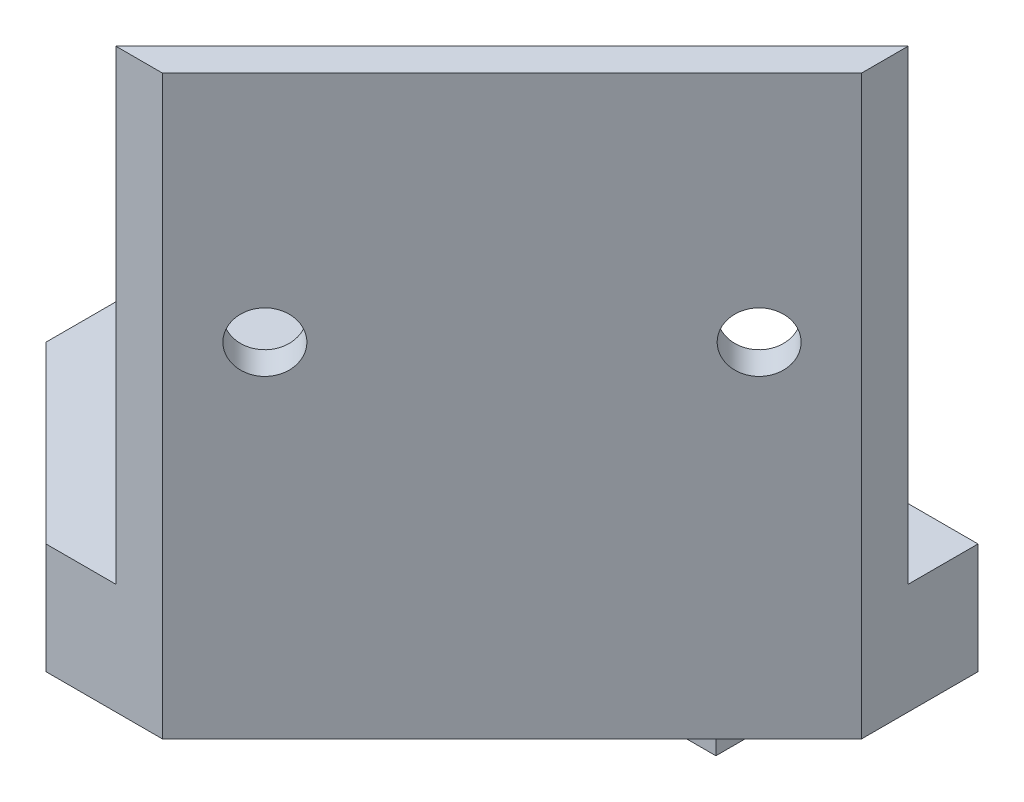
ISO-10303-21;
HEADER;
FILE_DESCRIPTION(('STEP AP214'),'2;1');
FILE_NAME('part.step','',(''),(''),'','','');
FILE_SCHEMA(('AUTOMOTIVE_DESIGN { 1 0 10303 214 1 1 1 1 }'));
ENDSEC;
DATA;
#1=APPLICATION_CONTEXT('core data for automotive mechanical design processes');
#2=APPLICATION_PROTOCOL_DEFINITION('international standard','automotive_design',2000,#1);
#3=PRODUCT_CONTEXT('',#1,'mechanical');
#4=PRODUCT('Part','Part','',(#3));
#5=PRODUCT_RELATED_PRODUCT_CATEGORY('part','',(#4));
#6=PRODUCT_DEFINITION_FORMATION('','',#4);
#7=PRODUCT_DEFINITION_CONTEXT('part definition',#1,'design');
#8=PRODUCT_DEFINITION('design','',#6,#7);
#9=PRODUCT_DEFINITION_SHAPE('','',#8);
#10=(LENGTH_UNIT() NAMED_UNIT(*) SI_UNIT(.MILLI.,.METRE.));
#11=(NAMED_UNIT(*) PLANE_ANGLE_UNIT() SI_UNIT($,.RADIAN.));
#12=(NAMED_UNIT(*) SI_UNIT($,.STERADIAN.) SOLID_ANGLE_UNIT());
#13=UNCERTAINTY_MEASURE_WITH_UNIT(LENGTH_MEASURE(1.E-05),#10,'distance_accuracy_value','');
#14=(GEOMETRIC_REPRESENTATION_CONTEXT(3) GLOBAL_UNCERTAINTY_ASSIGNED_CONTEXT((#13)) GLOBAL_UNIT_ASSIGNED_CONTEXT((#10,
#11,#12)) REPRESENTATION_CONTEXT('',''));
#15=CARTESIAN_POINT('',(0.,0.,0.));
#16=DIRECTION('',(0.,0.,1.));
#17=DIRECTION('',(1.,0.,0.));
#18=AXIS2_PLACEMENT_3D('',#15,#16,#17);
#19=CARTESIAN_POINT('',(55.,49.5,6.));
#20=DIRECTION('',(0.707106781186548,0.,0.707106781186548));
#21=DIRECTION('',(0.707106781186548,0.,-0.707106781186548));
#22=AXIS2_PLACEMENT_3D('',#19,#20,#21);
#23=PLANE('',#22);
#24=DIRECTION('',(-0.707106781186547,0.,0.707106781186547));
#25=VECTOR('',#24,1.);
#26=CARTESIAN_POINT('',(55.,9.50000000000001,6.));
#27=LINE('',#26,#25);
#28=CARTESIAN_POINT('',(55.,9.5,5.99999999999999));
#29=VERTEX_POINT('',#28);
#30=CARTESIAN_POINT('',(21.,9.50000000000001,40.));
#31=VERTEX_POINT('',#30);
#32=EDGE_CURVE('E63',#29,#31,#27,.T.);
#33=ORIENTED_EDGE('',*,*,#32,.T.);
#34=DIRECTION('',(0.,-1.,0.));
#35=VECTOR('',#34,1.);
#36=CARTESIAN_POINT('',(21.,49.5,40.));
#37=LINE('',#36,#35);
#38=CARTESIAN_POINT('',(21.,49.5,40.));
#39=VERTEX_POINT('',#38);
#40=EDGE_CURVE('E513',#39,#31,#37,.T.);
#41=ORIENTED_EDGE('',*,*,#40,.F.);
#42=DIRECTION('',(-0.707106781186547,0.,0.707106781186547));
#43=VECTOR('',#42,1.);
#44=CARTESIAN_POINT('',(55.,49.5,6.));
#45=LINE('',#44,#43);
#46=CARTESIAN_POINT('',(55.,49.5,6.));
#47=VERTEX_POINT('',#46);
#48=EDGE_CURVE('E501',#47,#39,#45,.T.);
#49=ORIENTED_EDGE('',*,*,#48,.F.);
#50=DIRECTION('',(0.,-1.,0.));
#51=VECTOR('',#50,1.);
#52=CARTESIAN_POINT('',(55.,49.5,6.));
#53=LINE('',#52,#51);
#54=EDGE_CURVE('E516',#47,#29,#53,.T.);
#55=ORIENTED_EDGE('',*,*,#54,.T.);
#56=EDGE_LOOP('',(#33,#41,#49,#55));
#57=FACE_BOUND('',#56,.T.);
#58=CARTESIAN_POINT('',(27.3933982822018,29.5,33.6066017177982));
#59=DIRECTION('',(-0.707106781186547,0.,-0.707106781186548));
#60=DIRECTION('',(-0.707106781186548,0.,0.707106781186547));
#61=AXIS2_PLACEMENT_3D('',#58,#59,#60);
#62=CIRCLE('',#61,2.575);
#63=CARTESIAN_POINT('',(25.5725983206464,29.5,35.4274016793536));
#64=VERTEX_POINT('',#63);
#65=EDGE_CURVE('E486',#64,#64,#62,.T.);
#66=ORIENTED_EDGE('',*,*,#65,.F.);
#67=EDGE_LOOP('',(#66));
#68=FACE_BOUND('',#67,.T.);
#69=CARTESIAN_POINT('',(48.6066017177982,29.5,12.3933982822018));
#70=DIRECTION('',(-0.707106781186547,0.,-0.707106781186548));
#71=DIRECTION('',(-0.707106781186548,0.,0.707106781186547));
#72=AXIS2_PLACEMENT_3D('',#69,#70,#71);
#73=CIRCLE('',#72,2.575);
#74=CARTESIAN_POINT('',(46.7858017562429,29.5,14.2141982437572));
#75=VERTEX_POINT('',#74);
#76=EDGE_CURVE('E477',#75,#75,#73,.T.);
#77=ORIENTED_EDGE('',*,*,#76,.F.);
#78=EDGE_LOOP('',(#77));
#79=FACE_BOUND('',#78,.T.);
#80=ADVANCED_FACE('F41',(#57,#68,#79),#23,.F.);
#81=CARTESIAN_POINT('',(0.,9.50000000000001,40.));
#82=DIRECTION('',(0.,-1.,0.));
#83=DIRECTION('',(1.,0.,0.));
#84=AXIS2_PLACEMENT_3D('',#81,#82,#83);
#85=PLANE('',#84);
#86=DIRECTION('',(0.,0.,-1.));
#87=VECTOR('',#86,1.);
#88=CARTESIAN_POINT('',(0.,9.50000000000001,40.));
#89=LINE('',#88,#87);
#90=CARTESIAN_POINT('',(0.,9.50000000000001,25.));
#91=VERTEX_POINT('',#90);
#92=CARTESIAN_POINT('',(0.,9.50000000000001,0.));
#93=VERTEX_POINT('',#92);
#94=EDGE_CURVE('E131',#91,#93,#89,.T.);
#95=ORIENTED_EDGE('',*,*,#94,.F.);
#96=DIRECTION('',(-0.707106781186547,0.,-0.707106781186547));
#97=VECTOR('',#96,1.);
#98=CARTESIAN_POINT('',(15.,9.50000000000001,40.));
#99=LINE('',#98,#97);
#100=CARTESIAN_POINT('',(15.,9.50000000000001,40.));
#101=VERTEX_POINT('',#100);
#102=EDGE_CURVE('E121',#101,#91,#99,.T.);
#103=ORIENTED_EDGE('',*,*,#102,.F.);
#104=DIRECTION('',(-1.,0.,0.));
#105=VECTOR('',#104,1.);
#106=CARTESIAN_POINT('',(0.,9.50000000000001,40.));
#107=LINE('',#106,#105);
#108=EDGE_CURVE('E141',#31,#101,#107,.T.);
#109=ORIENTED_EDGE('',*,*,#108,.F.);
#110=ORIENTED_EDGE('',*,*,#32,.F.);
#111=DIRECTION('',(0.,0.,-1.));
#112=VECTOR('',#111,1.);
#113=CARTESIAN_POINT('',(55.,9.5,40.));
#114=LINE('',#113,#112);
#115=CARTESIAN_POINT('',(55.,9.5,0.));
#116=VERTEX_POINT('',#115);
#117=EDGE_CURVE('E140',#29,#116,#114,.T.);
#118=ORIENTED_EDGE('',*,*,#117,.T.);
#119=DIRECTION('',(-1.,0.,0.));
#120=VECTOR('',#119,1.);
#121=CARTESIAN_POINT('',(0.,9.50000000000001,0.));
#122=LINE('',#121,#120);
#123=EDGE_CURVE('E139',#116,#93,#122,.T.);
#124=ORIENTED_EDGE('',*,*,#123,.T.);
#125=EDGE_LOOP('',(#95,#103,#109,#110,#118,#124));
#126=FACE_BOUND('',#125,.T.);
#127=ADVANCED_FACE('F137',(#126),#85,.F.);
#128=CARTESIAN_POINT('',(0.,0.,7.5));
#129=DIRECTION('',(1.,0.,0.));
#130=DIRECTION('',(0.,1.,0.));
#131=AXIS2_PLACEMENT_3D('',#128,#129,#130);
#132=PLANE('',#131);
#133=DIRECTION('',(0.,0.,-1.));
#134=VECTOR('',#133,1.);
#135=CARTESIAN_POINT('',(0.,0.,40.));
#136=LINE('',#135,#134);
#137=CARTESIAN_POINT('',(0.,0.,25.));
#138=VERTEX_POINT('',#137);
#139=CARTESIAN_POINT('',(0.,0.,7.5));
#140=VERTEX_POINT('',#139);
#141=EDGE_CURVE('E134',#138,#140,#136,.T.);
#142=ORIENTED_EDGE('',*,*,#141,.F.);
#143=DIRECTION('',(0.,1.,0.));
#144=VECTOR('',#143,1.);
#145=CARTESIAN_POINT('',(0.,-10.,25.));
#146=LINE('',#145,#144);
#147=EDGE_CURVE('E124',#138,#91,#146,.T.);
#148=ORIENTED_EDGE('',*,*,#147,.T.);
#149=ORIENTED_EDGE('',*,*,#94,.T.);
#150=DIRECTION('',(0.,-1.,0.));
#151=VECTOR('',#150,1.);
#152=CARTESIAN_POINT('',(0.,0.,0.));
#153=LINE('',#152,#151);
#154=CARTESIAN_POINT('',(0.,-10.,0.));
#155=VERTEX_POINT('',#154);
#156=EDGE_CURVE('E182',#93,#155,#153,.T.);
#157=ORIENTED_EDGE('',*,*,#156,.T.);
#158=DIRECTION('',(0.,0.,-1.));
#159=VECTOR('',#158,1.);
#160=CARTESIAN_POINT('',(0.,-10.,7.5));
#161=LINE('',#160,#159);
#162=CARTESIAN_POINT('',(0.,-10.,7.5));
#163=VERTEX_POINT('',#162);
#164=EDGE_CURVE('E49',#163,#155,#161,.T.);
#165=ORIENTED_EDGE('',*,*,#164,.F.);
#166=DIRECTION('',(0.,-1.,0.));
#167=VECTOR('',#166,1.);
#168=CARTESIAN_POINT('',(0.,0.,7.5));
#169=LINE('',#168,#167);
#170=EDGE_CURVE('E183',#140,#163,#169,.T.);
#171=ORIENTED_EDGE('',*,*,#170,.F.);
#172=EDGE_LOOP('',(#142,#148,#149,#157,#165,#171));
#173=FACE_BOUND('',#172,.T.);
#174=ADVANCED_FACE('F43',(#173),#132,.F.);
#175=CARTESIAN_POINT('',(0.,-10.,7.5));
#176=DIRECTION('',(0.,1.,0.));
#177=DIRECTION('',(0.,0.,1.));
#178=AXIS2_PLACEMENT_3D('',#175,#176,#177);
#179=PLANE('',#178);
#180=DIRECTION('',(1.,0.,0.));
#181=VECTOR('',#180,1.);
#182=CARTESIAN_POINT('',(0.,-10.,0.));
#183=LINE('',#182,#181);
#184=CARTESIAN_POINT('',(40.,-10.,0.));
#185=VERTEX_POINT('',#184);
#186=EDGE_CURVE('E196',#155,#185,#183,.T.);
#187=ORIENTED_EDGE('',*,*,#186,.T.);
#188=DIRECTION('',(0.,0.,-1.));
#189=VECTOR('',#188,1.);
#190=CARTESIAN_POINT('',(40.,-10.,7.5));
#191=LINE('',#190,#189);
#192=CARTESIAN_POINT('',(40.,-10.,7.5));
#193=VERTEX_POINT('',#192);
#194=EDGE_CURVE('E201',#193,#185,#191,.T.);
#195=ORIENTED_EDGE('',*,*,#194,.F.);
#196=DIRECTION('',(1.,0.,0.));
#197=VECTOR('',#196,1.);
#198=CARTESIAN_POINT('',(0.,-10.,7.5));
#199=LINE('',#198,#197);
#200=EDGE_CURVE('E186',#163,#193,#199,.T.);
#201=ORIENTED_EDGE('',*,*,#200,.F.);
#202=ORIENTED_EDGE('',*,*,#164,.T.);
#203=EDGE_LOOP('',(#187,#195,#201,#202));
#204=FACE_BOUND('',#203,.T.);
#205=ADVANCED_FACE('F206',(#204),#179,.F.);
#206=CARTESIAN_POINT('',(40.,0.,7.5));
#207=DIRECTION('',(-1.,0.,0.));
#208=DIRECTION('',(0.,0.,1.));
#209=AXIS2_PLACEMENT_3D('',#206,#207,#208);
#210=PLANE('',#209);
#211=DIRECTION('',(0.,1.,0.));
#212=VECTOR('',#211,1.);
#213=CARTESIAN_POINT('',(40.,0.,0.));
#214=LINE('',#213,#212);
#215=CARTESIAN_POINT('',(40.,0.,0.));
#216=VERTEX_POINT('',#215);
#217=EDGE_CURVE('E187',#185,#216,#214,.T.);
#218=ORIENTED_EDGE('',*,*,#217,.T.);
#219=DIRECTION('',(0.,0.,-1.));
#220=VECTOR('',#219,1.);
#221=CARTESIAN_POINT('',(40.,0.,7.5));
#222=LINE('',#221,#220);
#223=CARTESIAN_POINT('',(40.,0.,7.5));
#224=VERTEX_POINT('',#223);
#225=EDGE_CURVE('E194',#224,#216,#222,.T.);
#226=ORIENTED_EDGE('',*,*,#225,.F.);
#227=DIRECTION('',(0.,1.,0.));
#228=VECTOR('',#227,1.);
#229=CARTESIAN_POINT('',(40.,0.,7.5));
#230=LINE('',#229,#228);
#231=EDGE_CURVE('E189',#193,#224,#230,.T.);
#232=ORIENTED_EDGE('',*,*,#231,.F.);
#233=ORIENTED_EDGE('',*,*,#194,.T.);
#234=EDGE_LOOP('',(#218,#226,#232,#233));
#235=FACE_BOUND('',#234,.T.);
#236=ADVANCED_FACE('F217',(#235),#210,.F.);
#237=CARTESIAN_POINT('',(0.,0.,7.5));
#238=DIRECTION('',(0.,0.,1.));
#239=DIRECTION('',(1.,0.,0.));
#240=AXIS2_PLACEMENT_3D('',#237,#238,#239);
#241=PLANE('',#240);
#242=CARTESIAN_POINT('',(5.,-5.,7.5));
#243=DIRECTION('',(0.,0.,1.));
#244=DIRECTION('',(1.,0.,0.));
#245=AXIS2_PLACEMENT_3D('',#242,#243,#244);
#246=CIRCLE('',#245,3.275);
#247=CARTESIAN_POINT('',(8.275,-5.,7.5));
#248=VERTEX_POINT('',#247);
#249=EDGE_CURVE('E152',#248,#248,#246,.T.);
#250=ORIENTED_EDGE('',*,*,#249,.F.);
#251=EDGE_LOOP('',(#250));
#252=FACE_BOUND('',#251,.T.);
#253=CARTESIAN_POINT('',(35.,-5.,7.5));
#254=DIRECTION('',(0.,0.,1.));
#255=DIRECTION('',(1.,0.,0.));
#256=AXIS2_PLACEMENT_3D('',#253,#254,#255);
#257=CIRCLE('',#256,3.275);
#258=CARTESIAN_POINT('',(38.275,-5.,7.5));
#259=VERTEX_POINT('',#258);
#260=EDGE_CURVE('E167',#259,#259,#257,.T.);
#261=ORIENTED_EDGE('',*,*,#260,.F.);
#262=EDGE_LOOP('',(#261));
#263=FACE_BOUND('',#262,.T.);
#264=ORIENTED_EDGE('',*,*,#170,.T.);
#265=ORIENTED_EDGE('',*,*,#200,.T.);
#266=ORIENTED_EDGE('',*,*,#231,.T.);
#267=DIRECTION('',(-1.,0.,0.));
#268=VECTOR('',#267,1.);
#269=CARTESIAN_POINT('',(0.,0.,7.5));
#270=LINE('',#269,#268);
#271=EDGE_CURVE('E191',#224,#140,#270,.T.);
#272=ORIENTED_EDGE('',*,*,#271,.T.);
#273=EDGE_LOOP('',(#264,#265,#266,#272));
#274=FACE_BOUND('',#273,.T.);
#275=ADVANCED_FACE('F225',(#252,#263,#274),#241,.T.);
#276=CARTESIAN_POINT('',(0.,0.,0.));
#277=DIRECTION('',(0.,0.,1.));
#278=DIRECTION('',(1.,0.,0.));
#279=AXIS2_PLACEMENT_3D('',#276,#277,#278);
#280=PLANE('',#279);
#281=CARTESIAN_POINT('',(5.,-5.,0.));
#282=DIRECTION('',(0.,0.,1.));
#283=DIRECTION('',(1.,0.,0.));
#284=AXIS2_PLACEMENT_3D('',#281,#282,#283);
#285=CIRCLE('',#284,1.7);
#286=CARTESIAN_POINT('',(6.7,-5.,0.));
#287=VERTEX_POINT('',#286);
#288=EDGE_CURVE('E164',#287,#287,#285,.T.);
#289=ORIENTED_EDGE('',*,*,#288,.T.);
#290=EDGE_LOOP('',(#289));
#291=FACE_BOUND('',#290,.T.);
#292=CARTESIAN_POINT('',(35.,-5.,0.));
#293=DIRECTION('',(0.,0.,1.));
#294=DIRECTION('',(1.,0.,0.));
#295=AXIS2_PLACEMENT_3D('',#292,#293,#294);
#296=CIRCLE('',#295,1.7);
#297=CARTESIAN_POINT('',(36.7,-5.,0.));
#298=VERTEX_POINT('',#297);
#299=EDGE_CURVE('E179',#298,#298,#296,.T.);
#300=ORIENTED_EDGE('',*,*,#299,.T.);
#301=EDGE_LOOP('',(#300));
#302=FACE_BOUND('',#301,.T.);
#303=ORIENTED_EDGE('',*,*,#156,.F.);
#304=ORIENTED_EDGE('',*,*,#123,.F.);
#305=DIRECTION('',(0.,1.,0.));
#306=VECTOR('',#305,1.);
#307=CARTESIAN_POINT('',(55.,9.5,0.));
#308=LINE('',#307,#306);
#309=CARTESIAN_POINT('',(55.,0.,0.));
#310=VERTEX_POINT('',#309);
#311=EDGE_CURVE('E520',#310,#116,#308,.T.);
#312=ORIENTED_EDGE('',*,*,#311,.F.);
#313=DIRECTION('',(1.,0.,0.));
#314=VECTOR('',#313,1.);
#315=CARTESIAN_POINT('',(0.,0.,0.));
#316=LINE('',#315,#314);
#317=EDGE_CURVE('E214',#216,#310,#316,.T.);
#318=ORIENTED_EDGE('',*,*,#317,.F.);
#319=ORIENTED_EDGE('',*,*,#217,.F.);
#320=ORIENTED_EDGE('',*,*,#186,.F.);
#321=EDGE_LOOP('',(#303,#304,#312,#318,#319,#320));
#322=FACE_BOUND('',#321,.T.);
#323=ADVANCED_FACE('F209',(#291,#302,#322),#280,.F.);
#324=CARTESIAN_POINT('',(35.,-5.,7.5));
#325=DIRECTION('',(0.,0.,1.));
#326=DIRECTION('',(1.,0.,0.));
#327=AXIS2_PLACEMENT_3D('',#324,#325,#326);
#328=CYLINDRICAL_SURFACE('',#327,1.7);
#329=ORIENTED_EDGE('',*,*,#299,.F.);
#330=EDGE_LOOP('',(#329));
#331=FACE_BOUND('',#330,.T.);
#332=CARTESIAN_POINT('',(35.,-5.,4.5));
#333=DIRECTION('',(0.,0.,1.));
#334=DIRECTION('',(1.,0.,0.));
#335=AXIS2_PLACEMENT_3D('',#332,#333,#334);
#336=CIRCLE('',#335,1.7);
#337=CARTESIAN_POINT('',(36.7,-5.,4.5));
#338=VERTEX_POINT('',#337);
#339=EDGE_CURVE('E176',#338,#338,#336,.T.);
#340=ORIENTED_EDGE('',*,*,#339,.T.);
#341=EDGE_LOOP('',(#340));
#342=FACE_BOUND('',#341,.T.);
#343=ADVANCED_FACE('F233',(#331,#342),#328,.F.);
#344=CARTESIAN_POINT('',(38.25,-5.,4.5));
#345=DIRECTION('',(0.,0.,-1.));
#346=DIRECTION('',(-1.,0.,0.));
#347=AXIS2_PLACEMENT_3D('',#344,#345,#346);
#348=PLANE('',#347);
#349=ORIENTED_EDGE('',*,*,#339,.F.);
#350=EDGE_LOOP('',(#349));
#351=FACE_BOUND('',#350,.T.);
#352=CARTESIAN_POINT('',(35.,-5.,4.5));
#353=DIRECTION('',(0.,0.,1.));
#354=DIRECTION('',(1.,0.,0.));
#355=AXIS2_PLACEMENT_3D('',#352,#353,#354);
#356=CIRCLE('',#355,3.25);
#357=CARTESIAN_POINT('',(38.25,-5.,4.5));
#358=VERTEX_POINT('',#357);
#359=EDGE_CURVE('E173',#358,#358,#356,.T.);
#360=ORIENTED_EDGE('',*,*,#359,.T.);
#361=EDGE_LOOP('',(#360));
#362=FACE_BOUND('',#361,.T.);
#363=ADVANCED_FACE('F286',(#351,#362),#348,.F.);
#364=CARTESIAN_POINT('',(35.,-5.,7.5));
#365=DIRECTION('',(0.,0.,1.));
#366=DIRECTION('',(1.,0.,0.));
#367=AXIS2_PLACEMENT_3D('',#364,#365,#366);
#368=CYLINDRICAL_SURFACE('',#367,3.25);
#369=ORIENTED_EDGE('',*,*,#359,.F.);
#370=EDGE_LOOP('',(#369));
#371=FACE_BOUND('',#370,.T.);
#372=CARTESIAN_POINT('',(35.,-5.,7.475));
#373=DIRECTION('',(0.,0.,1.));
#374=DIRECTION('',(1.,0.,0.));
#375=AXIS2_PLACEMENT_3D('',#372,#373,#374);
#376=CIRCLE('',#375,3.25);
#377=CARTESIAN_POINT('',(38.25,-5.,7.475));
#378=VERTEX_POINT('',#377);
#379=EDGE_CURVE('E170',#378,#378,#376,.T.);
#380=ORIENTED_EDGE('',*,*,#379,.T.);
#381=EDGE_LOOP('',(#380));
#382=FACE_BOUND('',#381,.T.);
#383=ADVANCED_FACE('F282',(#371,#382),#368,.F.);
#384=CARTESIAN_POINT('',(35.,-5.,7.5));
#385=DIRECTION('',(0.,0.,1.));
#386=DIRECTION('',(1.,0.,0.));
#387=AXIS2_PLACEMENT_3D('',#384,#385,#386);
#388=CONICAL_SURFACE('',#387,3.275,0.785398163397379);
#389=ORIENTED_EDGE('',*,*,#379,.F.);
#390=EDGE_LOOP('',(#389));
#391=FACE_BOUND('',#390,.T.);
#392=ORIENTED_EDGE('',*,*,#260,.T.);
#393=EDGE_LOOP('',(#392));
#394=FACE_BOUND('',#393,.T.);
#395=ADVANCED_FACE('F278',(#391,#394),#388,.F.);
#396=CARTESIAN_POINT('',(5.,-5.,7.5));
#397=DIRECTION('',(0.,0.,1.));
#398=DIRECTION('',(1.,0.,0.));
#399=AXIS2_PLACEMENT_3D('',#396,#397,#398);
#400=CYLINDRICAL_SURFACE('',#399,1.7);
#401=ORIENTED_EDGE('',*,*,#288,.F.);
#402=EDGE_LOOP('',(#401));
#403=FACE_BOUND('',#402,.T.);
#404=CARTESIAN_POINT('',(5.,-5.,4.5));
#405=DIRECTION('',(0.,0.,1.));
#406=DIRECTION('',(1.,0.,0.));
#407=AXIS2_PLACEMENT_3D('',#404,#405,#406);
#408=CIRCLE('',#407,1.7);
#409=CARTESIAN_POINT('',(6.7,-5.,4.5));
#410=VERTEX_POINT('',#409);
#411=EDGE_CURVE('E161',#410,#410,#408,.T.);
#412=ORIENTED_EDGE('',*,*,#411,.T.);
#413=EDGE_LOOP('',(#412));
#414=FACE_BOUND('',#413,.T.);
#415=ADVANCED_FACE('F274',(#403,#414),#400,.F.);
#416=CARTESIAN_POINT('',(8.25,-5.,4.5));
#417=DIRECTION('',(0.,0.,-1.));
#418=DIRECTION('',(-1.,0.,0.));
#419=AXIS2_PLACEMENT_3D('',#416,#417,#418);
#420=PLANE('',#419);
#421=ORIENTED_EDGE('',*,*,#411,.F.);
#422=EDGE_LOOP('',(#421));
#423=FACE_BOUND('',#422,.T.);
#424=CARTESIAN_POINT('',(5.,-5.,4.5));
#425=DIRECTION('',(0.,0.,1.));
#426=DIRECTION('',(1.,0.,0.));
#427=AXIS2_PLACEMENT_3D('',#424,#425,#426);
#428=CIRCLE('',#427,3.25);
#429=CARTESIAN_POINT('',(8.25,-5.,4.5));
#430=VERTEX_POINT('',#429);
#431=EDGE_CURVE('E158',#430,#430,#428,.T.);
#432=ORIENTED_EDGE('',*,*,#431,.T.);
#433=EDGE_LOOP('',(#432));
#434=FACE_BOUND('',#433,.T.);
#435=ADVANCED_FACE('F270',(#423,#434),#420,.F.);
#436=CARTESIAN_POINT('',(5.,-5.,7.5));
#437=DIRECTION('',(0.,0.,1.));
#438=DIRECTION('',(1.,0.,0.));
#439=AXIS2_PLACEMENT_3D('',#436,#437,#438);
#440=CYLINDRICAL_SURFACE('',#439,3.25);
#441=ORIENTED_EDGE('',*,*,#431,.F.);
#442=EDGE_LOOP('',(#441));
#443=FACE_BOUND('',#442,.T.);
#444=CARTESIAN_POINT('',(5.,-5.,7.475));
#445=DIRECTION('',(0.,0.,1.));
#446=DIRECTION('',(1.,0.,0.));
#447=AXIS2_PLACEMENT_3D('',#444,#445,#446);
#448=CIRCLE('',#447,3.25);
#449=CARTESIAN_POINT('',(8.25,-5.,7.475));
#450=VERTEX_POINT('',#449);
#451=EDGE_CURVE('E155',#450,#450,#448,.T.);
#452=ORIENTED_EDGE('',*,*,#451,.T.);
#453=EDGE_LOOP('',(#452));
#454=FACE_BOUND('',#453,.T.);
#455=ADVANCED_FACE('F266',(#443,#454),#440,.F.);
#456=CARTESIAN_POINT('',(5.,-5.,7.5));
#457=DIRECTION('',(0.,0.,1.));
#458=DIRECTION('',(1.,0.,0.));
#459=AXIS2_PLACEMENT_3D('',#456,#457,#458);
#460=CONICAL_SURFACE('',#459,3.275,0.785398163397448);
#461=ORIENTED_EDGE('',*,*,#451,.F.);
#462=EDGE_LOOP('',(#461));
#463=FACE_BOUND('',#462,.T.);
#464=ORIENTED_EDGE('',*,*,#249,.T.);
#465=EDGE_LOOP('',(#464));
#466=FACE_BOUND('',#465,.T.);
#467=ADVANCED_FACE('F263',(#463,#466),#460,.F.);
#468=CARTESIAN_POINT('',(0.,0.,40.));
#469=DIRECTION('',(0.,1.,0.));
#470=DIRECTION('',(0.,0.,1.));
#471=AXIS2_PLACEMENT_3D('',#468,#469,#470);
#472=PLANE('',#471);
#473=DIRECTION('',(1.,0.,0.));
#474=VECTOR('',#473,1.);
#475=CARTESIAN_POINT('',(0.,0.,40.));
#476=LINE('',#475,#474);
#477=CARTESIAN_POINT('',(15.,0.,40.));
#478=VERTEX_POINT('',#477);
#479=CARTESIAN_POINT('',(25.,0.,40.));
#480=VERTEX_POINT('',#479);
#481=EDGE_CURVE('E145',#478,#480,#476,.T.);
#482=ORIENTED_EDGE('',*,*,#481,.F.);
#483=DIRECTION('',(-0.707106781186548,0.,-0.707106781186548));
#484=VECTOR('',#483,1.);
#485=CARTESIAN_POINT('',(7.5,0.,32.5));
#486=LINE('',#485,#484);
#487=EDGE_CURVE('E55',#478,#138,#486,.T.);
#488=ORIENTED_EDGE('',*,*,#487,.T.);
#489=ORIENTED_EDGE('',*,*,#141,.T.);
#490=ORIENTED_EDGE('',*,*,#271,.F.);
#491=ORIENTED_EDGE('',*,*,#225,.T.);
#492=ORIENTED_EDGE('',*,*,#317,.T.);
#493=DIRECTION('',(0.,0.,-1.));
#494=VECTOR('',#493,1.);
#495=CARTESIAN_POINT('',(55.,0.,40.));
#496=LINE('',#495,#494);
#497=CARTESIAN_POINT('',(55.,0.,9.99999999999999));
#498=VERTEX_POINT('',#497);
#499=EDGE_CURVE('E143',#498,#310,#496,.T.);
#500=ORIENTED_EDGE('',*,*,#499,.F.);
#501=DIRECTION('',(-0.707106781186547,0.,0.707106781186548));
#502=VECTOR('',#501,1.);
#503=CARTESIAN_POINT('',(12.5,0.,52.5));
#504=LINE('',#503,#502);
#505=EDGE_CURVE('E495',#498,#480,#504,.T.);
#506=ORIENTED_EDGE('',*,*,#505,.T.);
#507=EDGE_LOOP('',(#482,#488,#489,#490,#491,#492,#500,#506));
#508=FACE_BOUND('',#507,.T.);
#509=ADVANCED_FACE('F222',(#508),#472,.F.);
#510=CARTESIAN_POINT('',(55.,9.5,40.));
#511=DIRECTION('',(-1.,0.,0.));
#512=DIRECTION('',(0.,0.,1.));
#513=AXIS2_PLACEMENT_3D('',#510,#511,#512);
#514=PLANE('',#513);
#515=DIRECTION('',(0.,-1.,0.));
#516=VECTOR('',#515,1.);
#517=CARTESIAN_POINT('',(55.,49.5,10.));
#518=LINE('',#517,#516);
#519=CARTESIAN_POINT('',(55.,49.5,10.));
#520=VERTEX_POINT('',#519);
#521=EDGE_CURVE('E507',#520,#498,#518,.T.);
#522=ORIENTED_EDGE('',*,*,#521,.T.);
#523=ORIENTED_EDGE('',*,*,#499,.T.);
#524=ORIENTED_EDGE('',*,*,#311,.T.);
#525=ORIENTED_EDGE('',*,*,#117,.F.);
#526=ORIENTED_EDGE('',*,*,#54,.F.);
#527=DIRECTION('',(0.,0.,-1.));
#528=VECTOR('',#527,1.);
#529=CARTESIAN_POINT('',(55.,49.5,6.));
#530=LINE('',#529,#528);
#531=EDGE_CURVE('E498',#520,#47,#530,.T.);
#532=ORIENTED_EDGE('',*,*,#531,.F.);
#533=EDGE_LOOP('',(#522,#523,#524,#525,#526,#532));
#534=FACE_BOUND('',#533,.T.);
#535=ADVANCED_FACE('F256',(#534),#514,.F.);
#536=CARTESIAN_POINT('',(0.,0.,40.));
#537=DIRECTION('',(0.,0.,1.));
#538=DIRECTION('',(1.,0.,0.));
#539=AXIS2_PLACEMENT_3D('',#536,#537,#538);
#540=PLANE('',#539);
#541=DIRECTION('',(0.,1.,0.));
#542=VECTOR('',#541,1.);
#543=CARTESIAN_POINT('',(15.,0.,40.));
#544=LINE('',#543,#542);
#545=EDGE_CURVE('E11',#478,#101,#544,.T.);
#546=ORIENTED_EDGE('',*,*,#545,.F.);
#547=ORIENTED_EDGE('',*,*,#481,.T.);
#548=DIRECTION('',(0.,-1.,0.));
#549=VECTOR('',#548,1.);
#550=CARTESIAN_POINT('',(25.,49.5,40.));
#551=LINE('',#550,#549);
#552=CARTESIAN_POINT('',(25.,49.5,40.));
#553=VERTEX_POINT('',#552);
#554=EDGE_CURVE('E510',#553,#480,#551,.T.);
#555=ORIENTED_EDGE('',*,*,#554,.F.);
#556=DIRECTION('',(1.,0.,0.));
#557=VECTOR('',#556,1.);
#558=CARTESIAN_POINT('',(21.,49.5,40.));
#559=LINE('',#558,#557);
#560=EDGE_CURVE('E503',#39,#553,#559,.T.);
#561=ORIENTED_EDGE('',*,*,#560,.F.);
#562=ORIENTED_EDGE('',*,*,#40,.T.);
#563=ORIENTED_EDGE('',*,*,#108,.T.);
#564=EDGE_LOOP('',(#546,#547,#555,#561,#562,#563));
#565=FACE_BOUND('',#564,.T.);
#566=ADVANCED_FACE('F254',(#565),#540,.T.);
#567=CARTESIAN_POINT('',(55.,49.5,10.));
#568=DIRECTION('',(-0.707106781186548,0.,-0.707106781186548));
#569=DIRECTION('',(-0.707106781186548,0.,0.707106781186548));
#570=AXIS2_PLACEMENT_3D('',#567,#568,#569);
#571=PLANE('',#570);
#572=CARTESIAN_POINT('',(50.6066017177982,29.5,14.3933982822018));
#573=DIRECTION('',(-0.707106781186548,0.,-0.707106781186548));
#574=DIRECTION('',(-0.707106781186548,0.,0.707106781186548));
#575=AXIS2_PLACEMENT_3D('',#572,#573,#574);
#576=CIRCLE('',#575,2.55);
#577=CARTESIAN_POINT('',(48.8034794257725,29.5,16.1965205742275));
#578=VERTEX_POINT('',#577);
#579=EDGE_CURVE('E480',#578,#578,#576,.T.);
#580=ORIENTED_EDGE('',*,*,#579,.T.);
#581=EDGE_LOOP('',(#580));
#582=FACE_BOUND('',#581,.T.);
#583=CARTESIAN_POINT('',(29.3933982822018,29.5,35.6066017177982));
#584=DIRECTION('',(-0.707106781186548,0.,-0.707106781186548));
#585=DIRECTION('',(-0.707106781186548,0.,0.707106781186548));
#586=AXIS2_PLACEMENT_3D('',#583,#584,#585);
#587=CIRCLE('',#586,2.55);
#588=CARTESIAN_POINT('',(27.5902759901761,29.5,37.4097240098239));
#589=VERTEX_POINT('',#588);
#590=EDGE_CURVE('E492',#589,#589,#587,.T.);
#591=ORIENTED_EDGE('',*,*,#590,.T.);
#592=EDGE_LOOP('',(#591));
#593=FACE_BOUND('',#592,.T.);
#594=ORIENTED_EDGE('',*,*,#554,.T.);
#595=ORIENTED_EDGE('',*,*,#505,.F.);
#596=ORIENTED_EDGE('',*,*,#521,.F.);
#597=DIRECTION('',(0.707106781186547,0.,-0.707106781186547));
#598=VECTOR('',#597,1.);
#599=CARTESIAN_POINT('',(55.,49.5,10.));
#600=LINE('',#599,#598);
#601=EDGE_CURVE('E505',#553,#520,#600,.T.);
#602=ORIENTED_EDGE('',*,*,#601,.F.);
#603=EDGE_LOOP('',(#594,#595,#596,#602));
#604=FACE_BOUND('',#603,.T.);
#605=ADVANCED_FACE('F252',(#582,#593,#604),#571,.F.);
#606=CARTESIAN_POINT('',(0.,49.5,0.));
#607=DIRECTION('',(0.,1.,0.));
#608=DIRECTION('',(0.,0.,1.));
#609=AXIS2_PLACEMENT_3D('',#606,#607,#608);
#610=PLANE('',#609);
#611=ORIENTED_EDGE('',*,*,#531,.T.);
#612=ORIENTED_EDGE('',*,*,#48,.T.);
#613=ORIENTED_EDGE('',*,*,#560,.T.);
#614=ORIENTED_EDGE('',*,*,#601,.T.);
#615=EDGE_LOOP('',(#611,#612,#613,#614));
#616=FACE_BOUND('',#615,.T.);
#617=ADVANCED_FACE('F406',(#616),#610,.T.);
#618=CARTESIAN_POINT('',(27.3933982822018,29.5,33.6066017177982));
#619=DIRECTION('',(-0.707106781186547,0.,-0.707106781186548));
#620=DIRECTION('',(-0.707106781186548,0.,0.707106781186547));
#621=AXIS2_PLACEMENT_3D('',#618,#619,#620);
#622=CYLINDRICAL_SURFACE('',#621,2.55);
#623=ORIENTED_EDGE('',*,*,#590,.F.);
#624=EDGE_LOOP('',(#623));
#625=FACE_BOUND('',#624,.T.);
#626=CARTESIAN_POINT('',(27.4110759517315,29.5,33.6242793873279));
#627=DIRECTION('',(-0.707106781186547,0.,-0.707106781186548));
#628=DIRECTION('',(-0.707106781186548,0.,0.707106781186547));
#629=AXIS2_PLACEMENT_3D('',#626,#627,#628);
#630=CIRCLE('',#629,2.55);
#631=CARTESIAN_POINT('',(25.6079536597058,29.5,35.4274016793536));
#632=VERTEX_POINT('',#631);
#633=EDGE_CURVE('E489',#632,#632,#630,.T.);
#634=ORIENTED_EDGE('',*,*,#633,.T.);
#635=EDGE_LOOP('',(#634));
#636=FACE_BOUND('',#635,.T.);
#637=ADVANCED_FACE('F414',(#625,#636),#622,.F.);
#638=CARTESIAN_POINT('',(27.3933982822018,29.5,33.6066017177982));
#639=DIRECTION('',(-0.707106781186547,0.,-0.707106781186548));
#640=DIRECTION('',(-0.707106781186548,0.,0.707106781186547));
#641=AXIS2_PLACEMENT_3D('',#638,#639,#640);
#642=CONICAL_SURFACE('',#641,2.575,0.785398163397544);
#643=ORIENTED_EDGE('',*,*,#633,.F.);
#644=EDGE_LOOP('',(#643));
#645=FACE_BOUND('',#644,.T.);
#646=ORIENTED_EDGE('',*,*,#65,.T.);
#647=EDGE_LOOP('',(#646));
#648=FACE_BOUND('',#647,.T.);
#649=ADVANCED_FACE('F426',(#645,#648),#642,.F.);
#650=CARTESIAN_POINT('',(48.6066017177982,29.5,12.3933982822018));
#651=DIRECTION('',(-0.707106781186547,0.,-0.707106781186548));
#652=DIRECTION('',(-0.707106781186548,0.,0.707106781186547));
#653=AXIS2_PLACEMENT_3D('',#650,#651,#652);
#654=CYLINDRICAL_SURFACE('',#653,2.55);
#655=ORIENTED_EDGE('',*,*,#579,.F.);
#656=EDGE_LOOP('',(#655));
#657=FACE_BOUND('',#656,.T.);
#658=CARTESIAN_POINT('',(48.6242793873279,29.5,12.4110759517315));
#659=DIRECTION('',(-0.707106781186547,0.,-0.707106781186548));
#660=DIRECTION('',(-0.707106781186548,0.,0.707106781186547));
#661=AXIS2_PLACEMENT_3D('',#658,#659,#660);
#662=CIRCLE('',#661,2.55);
#663=CARTESIAN_POINT('',(46.8211570953022,29.5,14.2141982437572));
#664=VERTEX_POINT('',#663);
#665=EDGE_CURVE('E474',#664,#664,#662,.T.);
#666=ORIENTED_EDGE('',*,*,#665,.T.);
#667=EDGE_LOOP('',(#666));
#668=FACE_BOUND('',#667,.T.);
#669=ADVANCED_FACE('F435',(#657,#668),#654,.F.);
#670=CARTESIAN_POINT('',(48.6066017177982,29.5,12.3933982822018));
#671=DIRECTION('',(-0.707106781186547,0.,-0.707106781186548));
#672=DIRECTION('',(-0.707106781186548,0.,0.707106781186547));
#673=AXIS2_PLACEMENT_3D('',#670,#671,#672);
#674=CONICAL_SURFACE('',#673,2.575,0.785398163397429);
#675=ORIENTED_EDGE('',*,*,#665,.F.);
#676=EDGE_LOOP('',(#675));
#677=FACE_BOUND('',#676,.T.);
#678=ORIENTED_EDGE('',*,*,#76,.T.);
#679=EDGE_LOOP('',(#678));
#680=FACE_BOUND('',#679,.T.);
#681=ADVANCED_FACE('F444',(#677,#680),#674,.F.);
#682=CARTESIAN_POINT('',(15.,-10.,40.));
#683=DIRECTION('',(0.707106781186548,0.,-0.707106781186548));
#684=DIRECTION('',(-0.707106781186548,0.,-0.707106781186548));
#685=AXIS2_PLACEMENT_3D('',#682,#683,#684);
#686=PLANE('',#685);
#687=ORIENTED_EDGE('',*,*,#545,.T.);
#688=ORIENTED_EDGE('',*,*,#102,.T.);
#689=ORIENTED_EDGE('',*,*,#147,.F.);
#690=ORIENTED_EDGE('',*,*,#487,.F.);
#691=EDGE_LOOP('',(#687,#688,#689,#690));
#692=FACE_BOUND('',#691,.T.);
#693=ADVANCED_FACE('F123',(#692),#686,.F.);
#694=CLOSED_SHELL('',(#80,#127,#174,#205,#236,#275,#323,#343,#363,#383,#395,#415,#435,#455,#467,
#509,#535,#566,#605,#617,#637,#649,#669,#681,#693));
#695=MANIFOLD_SOLID_BREP('B2',#694);
#696=ADVANCED_BREP_SHAPE_REPRESENTATION('',(#18,#695),#14);
#697=SHAPE_DEFINITION_REPRESENTATION(#9,#696);
ENDSEC;
END-ISO-10303-21;
